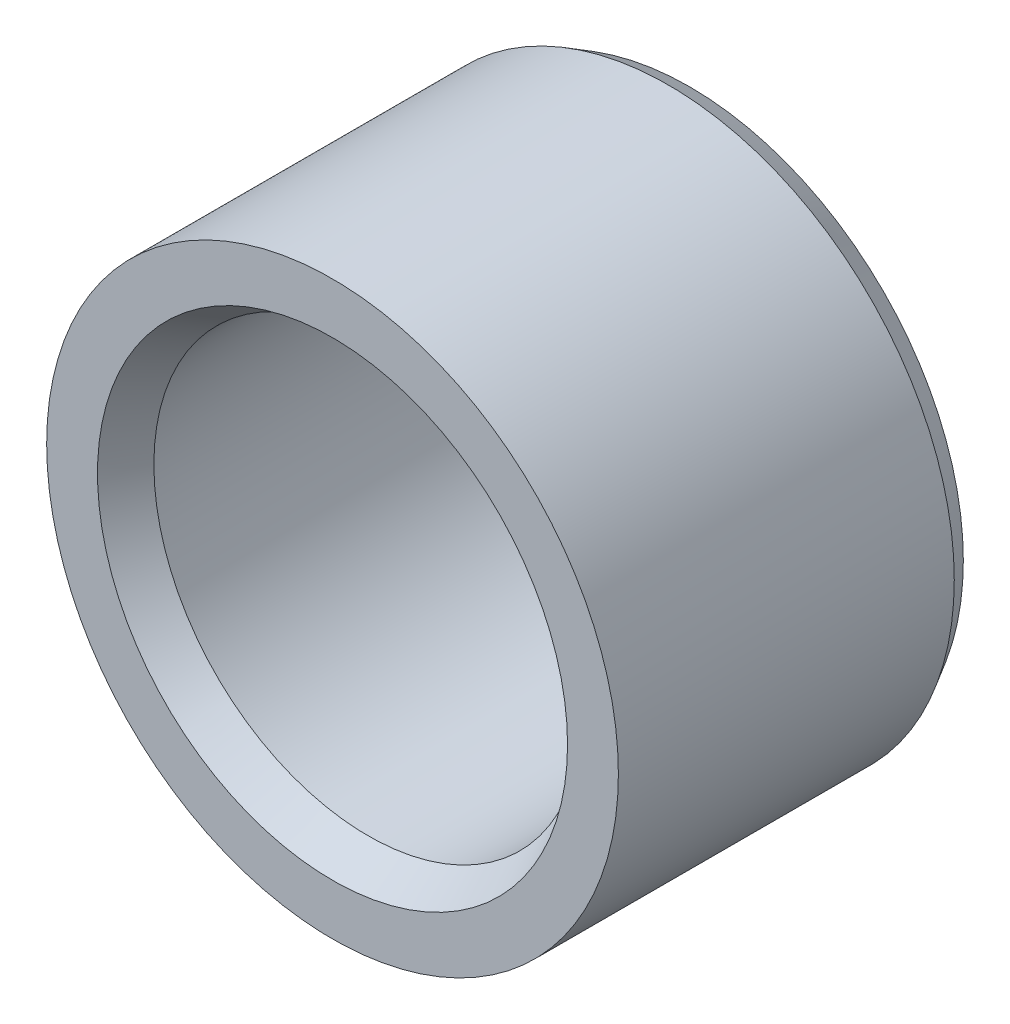
ISO-10303-21;
HEADER;
FILE_DESCRIPTION(('STEP AP214'),'2;1');
FILE_NAME('part.step','',(''),(''),'','','');
FILE_SCHEMA(('AUTOMOTIVE_DESIGN { 1 0 10303 214 1 1 1 1 }'));
ENDSEC;
DATA;
#1=APPLICATION_CONTEXT('core data for automotive mechanical design processes');
#2=APPLICATION_PROTOCOL_DEFINITION('international standard','automotive_design',2000,#1);
#3=PRODUCT_CONTEXT('',#1,'mechanical');
#4=PRODUCT('Part','Part','',(#3));
#5=PRODUCT_RELATED_PRODUCT_CATEGORY('part','',(#4));
#6=PRODUCT_DEFINITION_FORMATION('','',#4);
#7=PRODUCT_DEFINITION_CONTEXT('part definition',#1,'design');
#8=PRODUCT_DEFINITION('design','',#6,#7);
#9=PRODUCT_DEFINITION_SHAPE('','',#8);
#10=(LENGTH_UNIT() NAMED_UNIT(*) SI_UNIT(.MILLI.,.METRE.));
#11=(NAMED_UNIT(*) PLANE_ANGLE_UNIT() SI_UNIT($,.RADIAN.));
#12=(NAMED_UNIT(*) SI_UNIT($,.STERADIAN.) SOLID_ANGLE_UNIT());
#13=UNCERTAINTY_MEASURE_WITH_UNIT(LENGTH_MEASURE(1.E-05),#10,'distance_accuracy_value','');
#14=(GEOMETRIC_REPRESENTATION_CONTEXT(3) GLOBAL_UNCERTAINTY_ASSIGNED_CONTEXT((#13)) GLOBAL_UNIT_ASSIGNED_CONTEXT((#10,
#11,#12)) REPRESENTATION_CONTEXT('',''));
#15=CARTESIAN_POINT('',(0.,0.,0.));
#16=DIRECTION('',(0.,0.,1.));
#17=DIRECTION('',(1.,0.,0.));
#18=AXIS2_PLACEMENT_3D('',#15,#16,#17);
#19=CARTESIAN_POINT('',(0.,0.,5.));
#20=DIRECTION('',(0.,0.,1.));
#21=DIRECTION('',(1.,0.,0.));
#22=AXIS2_PLACEMENT_3D('',#19,#20,#21);
#23=PLANE('',#22);
#24=CARTESIAN_POINT('',(0.,0.,5.));
#25=DIRECTION('',(0.,0.,1.));
#26=DIRECTION('',(1.,0.,0.));
#27=AXIS2_PLACEMENT_3D('',#24,#25,#26);
#28=CIRCLE('',#27,3.28867513459481);
#29=CARTESIAN_POINT('',(3.28867513459481,0.,5.));
#30=VERTEX_POINT('',#29);
#31=EDGE_CURVE('E10',#30,#30,#28,.F.);
#32=ORIENTED_EDGE('',*,*,#31,.T.);
#33=EDGE_LOOP('',(#32));
#34=FACE_BOUND('',#33,.T.);
#35=CARTESIAN_POINT('',(0.,0.,5.));
#36=DIRECTION('',(0.,0.,1.));
#37=DIRECTION('',(1.,0.,0.));
#38=AXIS2_PLACEMENT_3D('',#35,#36,#37);
#39=CIRCLE('',#38,4.);
#40=CARTESIAN_POINT('',(4.,0.,5.));
#41=VERTEX_POINT('',#40);
#42=EDGE_CURVE('E63',#41,#41,#39,.T.);
#43=ORIENTED_EDGE('',*,*,#42,.T.);
#44=EDGE_LOOP('',(#43));
#45=FACE_BOUND('',#44,.T.);
#46=ADVANCED_FACE('F39',(#34,#45),#23,.T.);
#47=CARTESIAN_POINT('',(0.,0.,0.));
#48=DIRECTION('',(0.,0.,1.));
#49=DIRECTION('',(1.,0.,0.));
#50=AXIS2_PLACEMENT_3D('',#47,#48,#49);
#51=PLANE('',#50);
#52=CARTESIAN_POINT('',(0.,0.,0.));
#53=DIRECTION('',(0.,0.,1.));
#54=DIRECTION('',(1.,0.,0.));
#55=AXIS2_PLACEMENT_3D('',#52,#53,#54);
#56=CIRCLE('',#55,3.82679491924311);
#57=CARTESIAN_POINT('',(3.82679491924311,0.,0.));
#58=VERTEX_POINT('',#57);
#59=EDGE_CURVE('E52',#58,#58,#56,.F.);
#60=ORIENTED_EDGE('',*,*,#59,.T.);
#61=EDGE_LOOP('',(#60));
#62=FACE_BOUND('',#61,.T.);
#63=CARTESIAN_POINT('',(0.,0.,0.));
#64=DIRECTION('',(0.,0.,1.));
#65=DIRECTION('',(1.,0.,0.));
#66=AXIS2_PLACEMENT_3D('',#63,#64,#65);
#67=CIRCLE('',#66,3.);
#68=CARTESIAN_POINT('',(3.,0.,0.));
#69=VERTEX_POINT('',#68);
#70=EDGE_CURVE('E67',#69,#69,#67,.T.);
#71=ORIENTED_EDGE('',*,*,#70,.T.);
#72=EDGE_LOOP('',(#71));
#73=FACE_BOUND('',#72,.T.);
#74=ADVANCED_FACE('F72',(#62,#73),#51,.F.);
#75=CARTESIAN_POINT('',(0.,0.,5.));
#76=DIRECTION('',(0.,0.,-1.));
#77=DIRECTION('',(-1.,0.,0.));
#78=AXIS2_PLACEMENT_3D('',#75,#76,#77);
#79=CYLINDRICAL_SURFACE('',#78,4.);
#80=CARTESIAN_POINT('',(0.,0.,0.300000000000005));
#81=DIRECTION('',(0.,0.,1.));
#82=DIRECTION('',(1.,0.,0.));
#83=AXIS2_PLACEMENT_3D('',#80,#81,#82);
#84=CIRCLE('',#83,4.);
#85=CARTESIAN_POINT('',(4.,0.,0.300000000000005));
#86=VERTEX_POINT('',#85);
#87=EDGE_CURVE('E57',#86,#86,#84,.T.);
#88=ORIENTED_EDGE('',*,*,#87,.T.);
#89=EDGE_LOOP('',(#88));
#90=FACE_BOUND('',#89,.T.);
#91=ORIENTED_EDGE('',*,*,#42,.F.);
#92=EDGE_LOOP('',(#91));
#93=FACE_BOUND('',#92,.T.);
#94=ADVANCED_FACE('F77',(#90,#93),#79,.T.);
#95=CARTESIAN_POINT('',(0.,0.,5.));
#96=DIRECTION('',(0.,0.,-1.));
#97=DIRECTION('',(-1.,0.,0.));
#98=AXIS2_PLACEMENT_3D('',#95,#96,#97);
#99=CYLINDRICAL_SURFACE('',#98,3.);
#100=CARTESIAN_POINT('',(0.,0.,4.5));
#101=DIRECTION('',(0.,0.,1.));
#102=DIRECTION('',(1.,0.,0.));
#103=AXIS2_PLACEMENT_3D('',#100,#101,#102);
#104=CIRCLE('',#103,3.);
#105=CARTESIAN_POINT('',(3.,0.,4.5));
#106=VERTEX_POINT('',#105);
#107=EDGE_CURVE('E47',#106,#106,#104,.T.);
#108=ORIENTED_EDGE('',*,*,#107,.T.);
#109=EDGE_LOOP('',(#108));
#110=FACE_BOUND('',#109,.T.);
#111=ORIENTED_EDGE('',*,*,#70,.F.);
#112=EDGE_LOOP('',(#111));
#113=FACE_BOUND('',#112,.T.);
#114=ADVANCED_FACE('F74',(#110,#113),#99,.F.);
#115=CARTESIAN_POINT('',(0.,0.,0.300000000000005));
#116=DIRECTION('',(0.,0.,1.));
#117=DIRECTION('',(1.,0.,0.));
#118=AXIS2_PLACEMENT_3D('',#115,#116,#117);
#119=CONICAL_SURFACE('',#118,4.,0.523598775598297);
#120=ORIENTED_EDGE('',*,*,#59,.F.);
#121=EDGE_LOOP('',(#120));
#122=FACE_BOUND('',#121,.T.);
#123=ORIENTED_EDGE('',*,*,#87,.F.);
#124=EDGE_LOOP('',(#123));
#125=FACE_BOUND('',#124,.T.);
#126=ADVANCED_FACE('F76',(#122,#125),#119,.T.);
#127=CARTESIAN_POINT('',(0.,0.,4.5));
#128=DIRECTION('',(0.,0.,1.));
#129=DIRECTION('',(1.,0.,0.));
#130=AXIS2_PLACEMENT_3D('',#127,#128,#129);
#131=CONICAL_SURFACE('',#130,3.,0.523598775598297);
#132=ORIENTED_EDGE('',*,*,#31,.F.);
#133=EDGE_LOOP('',(#132));
#134=FACE_BOUND('',#133,.T.);
#135=ORIENTED_EDGE('',*,*,#107,.F.);
#136=EDGE_LOOP('',(#135));
#137=FACE_BOUND('',#136,.T.);
#138=ADVANCED_FACE('F41',(#134,#137),#131,.F.);
#139=CLOSED_SHELL('',(#46,#74,#94,#114,#126,#138));
#140=MANIFOLD_SOLID_BREP('B2',#139);
#141=ADVANCED_BREP_SHAPE_REPRESENTATION('',(#18,#140),#14);
#142=SHAPE_DEFINITION_REPRESENTATION(#9,#141);
ENDSEC;
END-ISO-10303-21;
